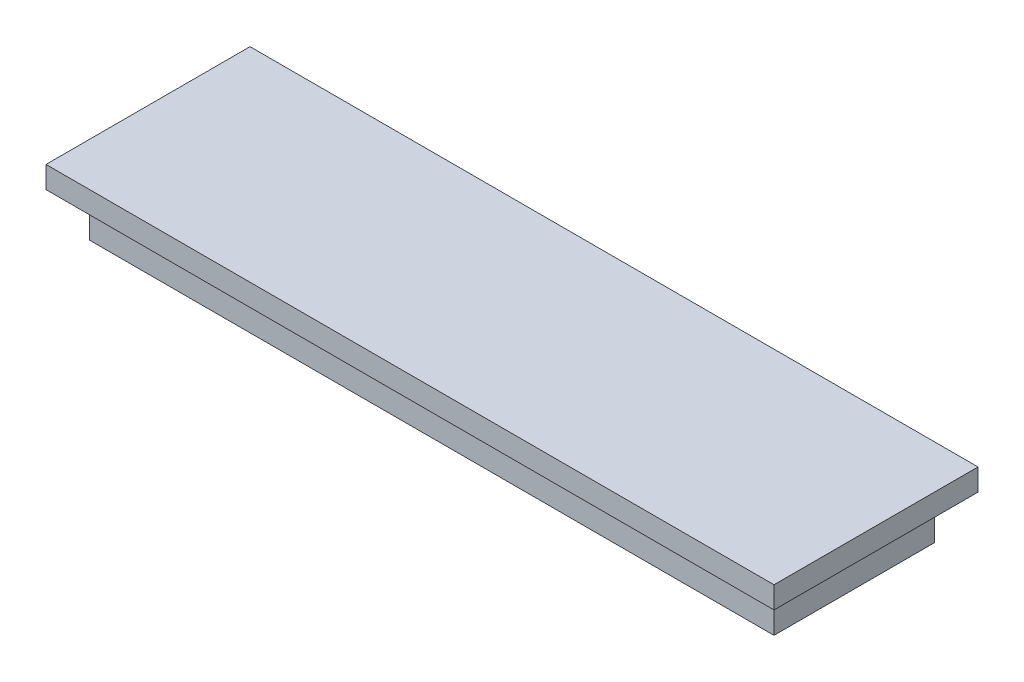
ISO-10303-21;
HEADER;
FILE_DESCRIPTION(('STEP AP214'),'2;1');
FILE_NAME('part.step','',(''),(''),'','','');
FILE_SCHEMA(('AUTOMOTIVE_DESIGN { 1 0 10303 214 1 1 1 1 }'));
ENDSEC;
DATA;
#1=APPLICATION_CONTEXT('core data for automotive mechanical design processes');
#2=APPLICATION_PROTOCOL_DEFINITION('international standard','automotive_design',2000,#1);
#3=PRODUCT_CONTEXT('',#1,'mechanical');
#4=PRODUCT('Part','Part','',(#3));
#5=PRODUCT_RELATED_PRODUCT_CATEGORY('part','',(#4));
#6=PRODUCT_DEFINITION_FORMATION('','',#4);
#7=PRODUCT_DEFINITION_CONTEXT('part definition',#1,'design');
#8=PRODUCT_DEFINITION('design','',#6,#7);
#9=PRODUCT_DEFINITION_SHAPE('','',#8);
#10=(LENGTH_UNIT() NAMED_UNIT(*) SI_UNIT(.MILLI.,.METRE.));
#11=(NAMED_UNIT(*) PLANE_ANGLE_UNIT() SI_UNIT($,.RADIAN.));
#12=(NAMED_UNIT(*) SI_UNIT($,.STERADIAN.) SOLID_ANGLE_UNIT());
#13=UNCERTAINTY_MEASURE_WITH_UNIT(LENGTH_MEASURE(1.E-05),#10,'distance_accuracy_value','');
#14=(GEOMETRIC_REPRESENTATION_CONTEXT(3) GLOBAL_UNCERTAINTY_ASSIGNED_CONTEXT((#13)) GLOBAL_UNIT_ASSIGNED_CONTEXT((#10,
#11,#12)) REPRESENTATION_CONTEXT('',''));
#15=CARTESIAN_POINT('',(0.,0.,0.));
#16=DIRECTION('',(0.,0.,1.));
#17=DIRECTION('',(1.,0.,0.));
#18=AXIS2_PLACEMENT_3D('',#15,#16,#17);
#19=CARTESIAN_POINT('',(-24.892,3.175,-5.842));
#20=DIRECTION('',(0.,0.,1.));
#21=DIRECTION('',(1.,0.,0.));
#22=AXIS2_PLACEMENT_3D('',#19,#20,#21);
#23=PLANE('',#22);
#24=DIRECTION('',(-1.,0.,0.));
#25=VECTOR('',#24,1.);
#26=CARTESIAN_POINT('',(-24.892,0.,-5.842));
#27=LINE('',#26,#25);
#28=CARTESIAN_POINT('',(24.892,0.,-5.842));
#29=VERTEX_POINT('',#28);
#30=CARTESIAN_POINT('',(-24.892,0.,-5.842));
#31=VERTEX_POINT('',#30);
#32=EDGE_CURVE('E131',#29,#31,#27,.T.);
#33=ORIENTED_EDGE('',*,*,#32,.T.);
#34=DIRECTION('',(0.,-1.,0.));
#35=VECTOR('',#34,1.);
#36=CARTESIAN_POINT('',(-24.892,3.175,-5.842));
#37=LINE('',#36,#35);
#38=CARTESIAN_POINT('',(-24.892,3.175,-5.842));
#39=VERTEX_POINT('',#38);
#40=EDGE_CURVE('E11',#39,#31,#37,.T.);
#41=ORIENTED_EDGE('',*,*,#40,.F.);
#42=DIRECTION('',(-1.,0.,0.));
#43=VECTOR('',#42,1.);
#44=CARTESIAN_POINT('',(-24.892,3.175,-5.842));
#45=LINE('',#44,#43);
#46=CARTESIAN_POINT('',(24.892,3.175,-5.842));
#47=VERTEX_POINT('',#46);
#48=EDGE_CURVE('E140',#47,#39,#45,.T.);
#49=ORIENTED_EDGE('',*,*,#48,.F.);
#50=DIRECTION('',(0.,-1.,0.));
#51=VECTOR('',#50,1.);
#52=CARTESIAN_POINT('',(24.892,3.175,-5.842));
#53=LINE('',#52,#51);
#54=EDGE_CURVE('E149',#47,#29,#53,.T.);
#55=ORIENTED_EDGE('',*,*,#54,.T.);
#56=EDGE_LOOP('',(#33,#41,#49,#55));
#57=FACE_BOUND('',#56,.T.);
#58=ADVANCED_FACE('F33',(#57),#23,.F.);
#59=CARTESIAN_POINT('',(-24.892,3.175,-5.842));
#60=DIRECTION('',(1.,0.,0.));
#61=DIRECTION('',(0.,0.,-1.));
#62=AXIS2_PLACEMENT_3D('',#59,#60,#61);
#63=PLANE('',#62);
#64=DIRECTION('',(0.,0.,1.));
#65=VECTOR('',#64,1.);
#66=CARTESIAN_POINT('',(-24.892,0.,-5.842));
#67=LINE('',#66,#65);
#68=CARTESIAN_POINT('',(-24.892,0.,5.842));
#69=VERTEX_POINT('',#68);
#70=EDGE_CURVE('E134',#31,#69,#67,.T.);
#71=ORIENTED_EDGE('',*,*,#70,.T.);
#72=DIRECTION('',(0.,-1.,0.));
#73=VECTOR('',#72,1.);
#74=CARTESIAN_POINT('',(-24.892,3.175,5.842));
#75=LINE('',#74,#73);
#76=CARTESIAN_POINT('',(-24.892,3.175,5.842));
#77=VERTEX_POINT('',#76);
#78=EDGE_CURVE('E41',#77,#69,#75,.T.);
#79=ORIENTED_EDGE('',*,*,#78,.F.);
#80=DIRECTION('',(0.,0.,1.));
#81=VECTOR('',#80,1.);
#82=CARTESIAN_POINT('',(-24.892,3.175,-5.842));
#83=LINE('',#82,#81);
#84=EDGE_CURVE('E75',#39,#77,#83,.T.);
#85=ORIENTED_EDGE('',*,*,#84,.F.);
#86=ORIENTED_EDGE('',*,*,#40,.T.);
#87=EDGE_LOOP('',(#71,#79,#85,#86));
#88=FACE_BOUND('',#87,.T.);
#89=ADVANCED_FACE('F175',(#88),#63,.F.);
#90=CARTESIAN_POINT('',(-24.892,3.175,5.842));
#91=DIRECTION('',(0.,0.,-1.));
#92=DIRECTION('',(-1.,0.,0.));
#93=AXIS2_PLACEMENT_3D('',#90,#91,#92);
#94=PLANE('',#93);
#95=DIRECTION('',(1.,0.,0.));
#96=VECTOR('',#95,1.);
#97=CARTESIAN_POINT('',(-24.892,0.,5.842));
#98=LINE('',#97,#96);
#99=CARTESIAN_POINT('',(24.892,0.,5.842));
#100=VERTEX_POINT('',#99);
#101=EDGE_CURVE('E65',#69,#100,#98,.T.);
#102=ORIENTED_EDGE('',*,*,#101,.T.);
#103=DIRECTION('',(0.,-1.,0.));
#104=VECTOR('',#103,1.);
#105=CARTESIAN_POINT('',(24.892,3.175,5.842));
#106=LINE('',#105,#104);
#107=CARTESIAN_POINT('',(24.892,3.175,5.842));
#108=VERTEX_POINT('',#107);
#109=EDGE_CURVE('E49',#108,#100,#106,.T.);
#110=ORIENTED_EDGE('',*,*,#109,.F.);
#111=DIRECTION('',(1.,0.,0.));
#112=VECTOR('',#111,1.);
#113=CARTESIAN_POINT('',(-24.892,3.175,5.842));
#114=LINE('',#113,#112);
#115=EDGE_CURVE('E144',#77,#108,#114,.T.);
#116=ORIENTED_EDGE('',*,*,#115,.F.);
#117=ORIENTED_EDGE('',*,*,#78,.T.);
#118=EDGE_LOOP('',(#102,#110,#116,#117));
#119=FACE_BOUND('',#118,.T.);
#120=ADVANCED_FACE('F155',(#119),#94,.F.);
#121=CARTESIAN_POINT('',(24.892,3.175,-5.842));
#122=DIRECTION('',(-1.,0.,0.));
#123=DIRECTION('',(0.,0.,1.));
#124=AXIS2_PLACEMENT_3D('',#121,#122,#123);
#125=PLANE('',#124);
#126=DIRECTION('',(0.,0.,-1.));
#127=VECTOR('',#126,1.);
#128=CARTESIAN_POINT('',(24.892,0.,-5.842));
#129=LINE('',#128,#127);
#130=EDGE_CURVE('E70',#100,#29,#129,.T.);
#131=ORIENTED_EDGE('',*,*,#130,.T.);
#132=ORIENTED_EDGE('',*,*,#54,.F.);
#133=DIRECTION('',(0.,0.,-1.));
#134=VECTOR('',#133,1.);
#135=CARTESIAN_POINT('',(24.892,3.175,-5.842));
#136=LINE('',#135,#134);
#137=EDGE_CURVE('E147',#108,#47,#136,.T.);
#138=ORIENTED_EDGE('',*,*,#137,.F.);
#139=ORIENTED_EDGE('',*,*,#109,.T.);
#140=EDGE_LOOP('',(#131,#132,#138,#139));
#141=FACE_BOUND('',#140,.T.);
#142=ADVANCED_FACE('F160',(#141),#125,.F.);
#143=CARTESIAN_POINT('',(0.,0.,0.));
#144=DIRECTION('',(0.,-1.,0.));
#145=DIRECTION('',(0.,0.,-1.));
#146=AXIS2_PLACEMENT_3D('',#143,#144,#145);
#147=PLANE('',#146);
#148=ORIENTED_EDGE('',*,*,#32,.F.);
#149=ORIENTED_EDGE('',*,*,#130,.F.);
#150=ORIENTED_EDGE('',*,*,#101,.F.);
#151=ORIENTED_EDGE('',*,*,#70,.F.);
#152=EDGE_LOOP('',(#148,#149,#150,#151));
#153=FACE_BOUND('',#152,.T.);
#154=ADVANCED_FACE('F158',(#153),#147,.T.);
#155=CARTESIAN_POINT('',(0.,3.175,0.));
#156=DIRECTION('',(0.,1.,0.));
#157=DIRECTION('',(0.,0.,1.));
#158=AXIS2_PLACEMENT_3D('',#155,#156,#157);
#159=PLANE('',#158);
#160=DIRECTION('',(0.,0.,-1.));
#161=VECTOR('',#160,1.);
#162=CARTESIAN_POINT('',(26.4668,3.175,7.4168));
#163=LINE('',#162,#161);
#164=CARTESIAN_POINT('',(26.4668,3.175,7.4168));
#165=VERTEX_POINT('',#164);
#166=CARTESIAN_POINT('',(26.4668,3.175,-7.4168));
#167=VERTEX_POINT('',#166);
#168=EDGE_CURVE('E130',#165,#167,#163,.T.);
#169=ORIENTED_EDGE('',*,*,#168,.F.);
#170=DIRECTION('',(1.,0.,0.));
#171=VECTOR('',#170,1.);
#172=CARTESIAN_POINT('',(-26.4668,3.175,7.4168));
#173=LINE('',#172,#171);
#174=CARTESIAN_POINT('',(-26.4668,3.175,7.4168));
#175=VERTEX_POINT('',#174);
#176=EDGE_CURVE('E126',#175,#165,#173,.T.);
#177=ORIENTED_EDGE('',*,*,#176,.F.);
#178=DIRECTION('',(0.,0.,1.));
#179=VECTOR('',#178,1.);
#180=CARTESIAN_POINT('',(-26.4668,3.175,-7.4168));
#181=LINE('',#180,#179);
#182=CARTESIAN_POINT('',(-26.4668,3.175,-7.4168));
#183=VERTEX_POINT('',#182);
#184=EDGE_CURVE('E202',#183,#175,#181,.T.);
#185=ORIENTED_EDGE('',*,*,#184,.F.);
#186=DIRECTION('',(-1.,0.,0.));
#187=VECTOR('',#186,1.);
#188=CARTESIAN_POINT('',(26.4668,3.175,-7.4168));
#189=LINE('',#188,#187);
#190=EDGE_CURVE('E205',#167,#183,#189,.T.);
#191=ORIENTED_EDGE('',*,*,#190,.F.);
#192=EDGE_LOOP('',(#169,#177,#185,#191));
#193=FACE_BOUND('',#192,.T.);
#194=ORIENTED_EDGE('',*,*,#137,.T.);
#195=ORIENTED_EDGE('',*,*,#48,.T.);
#196=ORIENTED_EDGE('',*,*,#84,.T.);
#197=ORIENTED_EDGE('',*,*,#115,.T.);
#198=EDGE_LOOP('',(#194,#195,#196,#197));
#199=FACE_BOUND('',#198,.T.);
#200=ADVANCED_FACE('F162',(#193,#199),#159,.F.);
#201=CARTESIAN_POINT('',(26.4668,4.7625,7.4168));
#202=DIRECTION('',(-1.,0.,0.));
#203=DIRECTION('',(0.,0.,1.));
#204=AXIS2_PLACEMENT_3D('',#201,#202,#203);
#205=PLANE('',#204);
#206=ORIENTED_EDGE('',*,*,#168,.T.);
#207=DIRECTION('',(0.,-1.,0.));
#208=VECTOR('',#207,1.);
#209=CARTESIAN_POINT('',(26.4668,4.7625,-7.4168));
#210=LINE('',#209,#208);
#211=CARTESIAN_POINT('',(26.4668,4.7625,-7.4168));
#212=VERTEX_POINT('',#211);
#213=EDGE_CURVE('E110',#212,#167,#210,.T.);
#214=ORIENTED_EDGE('',*,*,#213,.F.);
#215=DIRECTION('',(0.,0.,-1.));
#216=VECTOR('',#215,1.);
#217=CARTESIAN_POINT('',(26.4668,4.7625,7.4168));
#218=LINE('',#217,#216);
#219=CARTESIAN_POINT('',(26.4668,4.7625,7.4168));
#220=VERTEX_POINT('',#219);
#221=EDGE_CURVE('E117',#220,#212,#218,.T.);
#222=ORIENTED_EDGE('',*,*,#221,.F.);
#223=DIRECTION('',(0.,-1.,0.));
#224=VECTOR('',#223,1.);
#225=CARTESIAN_POINT('',(26.4668,4.7625,7.4168));
#226=LINE('',#225,#224);
#227=EDGE_CURVE('E199',#220,#165,#226,.T.);
#228=ORIENTED_EDGE('',*,*,#227,.T.);
#229=EDGE_LOOP('',(#206,#214,#222,#228));
#230=FACE_BOUND('',#229,.T.);
#231=ADVANCED_FACE('F128',(#230),#205,.F.);
#232=CARTESIAN_POINT('',(26.4668,4.7625,-7.4168));
#233=DIRECTION('',(0.,0.,1.));
#234=DIRECTION('',(1.,0.,0.));
#235=AXIS2_PLACEMENT_3D('',#232,#233,#234);
#236=PLANE('',#235);
#237=ORIENTED_EDGE('',*,*,#190,.T.);
#238=DIRECTION('',(0.,-1.,0.));
#239=VECTOR('',#238,1.);
#240=CARTESIAN_POINT('',(-26.4668,4.7625,-7.4168));
#241=LINE('',#240,#239);
#242=CARTESIAN_POINT('',(-26.4668,4.7625,-7.4168));
#243=VERTEX_POINT('',#242);
#244=EDGE_CURVE('E113',#243,#183,#241,.T.);
#245=ORIENTED_EDGE('',*,*,#244,.F.);
#246=DIRECTION('',(-1.,0.,0.));
#247=VECTOR('',#246,1.);
#248=CARTESIAN_POINT('',(26.4668,4.7625,-7.4168));
#249=LINE('',#248,#247);
#250=EDGE_CURVE('E106',#212,#243,#249,.T.);
#251=ORIENTED_EDGE('',*,*,#250,.F.);
#252=ORIENTED_EDGE('',*,*,#213,.T.);
#253=EDGE_LOOP('',(#237,#245,#251,#252));
#254=FACE_BOUND('',#253,.T.);
#255=ADVANCED_FACE('F108',(#254),#236,.F.);
#256=CARTESIAN_POINT('',(-26.4668,4.7625,-7.4168));
#257=DIRECTION('',(1.,0.,0.));
#258=DIRECTION('',(0.,0.,-1.));
#259=AXIS2_PLACEMENT_3D('',#256,#257,#258);
#260=PLANE('',#259);
#261=ORIENTED_EDGE('',*,*,#184,.T.);
#262=DIRECTION('',(0.,-1.,0.));
#263=VECTOR('',#262,1.);
#264=CARTESIAN_POINT('',(-26.4668,4.7625,7.4168));
#265=LINE('',#264,#263);
#266=CARTESIAN_POINT('',(-26.4668,4.7625,7.4168));
#267=VERTEX_POINT('',#266);
#268=EDGE_CURVE('E136',#267,#175,#265,.T.);
#269=ORIENTED_EDGE('',*,*,#268,.F.);
#270=DIRECTION('',(0.,0.,1.));
#271=VECTOR('',#270,1.);
#272=CARTESIAN_POINT('',(-26.4668,4.7625,-7.4168));
#273=LINE('',#272,#271);
#274=EDGE_CURVE('E116',#243,#267,#273,.T.);
#275=ORIENTED_EDGE('',*,*,#274,.F.);
#276=ORIENTED_EDGE('',*,*,#244,.T.);
#277=EDGE_LOOP('',(#261,#269,#275,#276));
#278=FACE_BOUND('',#277,.T.);
#279=ADVANCED_FACE('F188',(#278),#260,.F.);
#280=CARTESIAN_POINT('',(-26.4668,4.7625,7.4168));
#281=DIRECTION('',(0.,0.,-1.));
#282=DIRECTION('',(-1.,0.,0.));
#283=AXIS2_PLACEMENT_3D('',#280,#281,#282);
#284=PLANE('',#283);
#285=ORIENTED_EDGE('',*,*,#176,.T.);
#286=ORIENTED_EDGE('',*,*,#227,.F.);
#287=DIRECTION('',(1.,0.,0.));
#288=VECTOR('',#287,1.);
#289=CARTESIAN_POINT('',(-26.4668,4.7625,7.4168));
#290=LINE('',#289,#288);
#291=EDGE_CURVE('E122',#267,#220,#290,.T.);
#292=ORIENTED_EDGE('',*,*,#291,.F.);
#293=ORIENTED_EDGE('',*,*,#268,.T.);
#294=EDGE_LOOP('',(#285,#286,#292,#293));
#295=FACE_BOUND('',#294,.T.);
#296=ADVANCED_FACE('F190',(#295),#284,.F.);
#297=CARTESIAN_POINT('',(0.,4.7625,0.));
#298=DIRECTION('',(0.,1.,0.));
#299=DIRECTION('',(0.,0.,1.));
#300=AXIS2_PLACEMENT_3D('',#297,#298,#299);
#301=PLANE('',#300);
#302=ORIENTED_EDGE('',*,*,#221,.T.);
#303=ORIENTED_EDGE('',*,*,#250,.T.);
#304=ORIENTED_EDGE('',*,*,#274,.T.);
#305=ORIENTED_EDGE('',*,*,#291,.T.);
#306=EDGE_LOOP('',(#302,#303,#304,#305));
#307=FACE_BOUND('',#306,.T.);
#308=ADVANCED_FACE('F120',(#307),#301,.T.);
#309=CLOSED_SHELL('',(#58,#89,#120,#142,#154,#200,#231,#255,#279,#296,#308));
#310=MANIFOLD_SOLID_BREP('B2',#309);
#311=ADVANCED_BREP_SHAPE_REPRESENTATION('',(#18,#310),#14);
#312=SHAPE_DEFINITION_REPRESENTATION(#9,#311);
ENDSEC;
END-ISO-10303-21;
